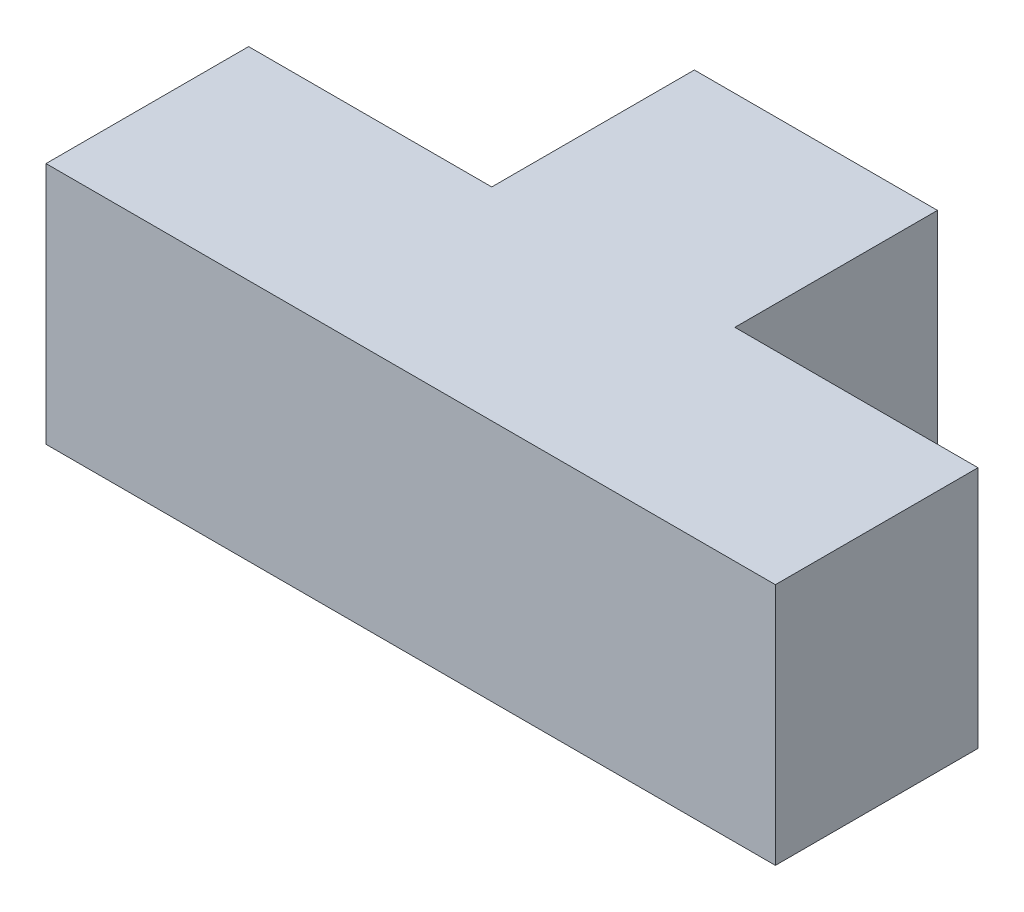
ISO-10303-21;
HEADER;
FILE_DESCRIPTION(('STEP AP214'),'2;1');
FILE_NAME('part.step','',(''),(''),'','','');
FILE_SCHEMA(('AUTOMOTIVE_DESIGN { 1 0 10303 214 1 1 1 1 }'));
ENDSEC;
DATA;
#1=APPLICATION_CONTEXT('core data for automotive mechanical design processes');
#2=APPLICATION_PROTOCOL_DEFINITION('international standard','automotive_design',2000,#1);
#3=PRODUCT_CONTEXT('',#1,'mechanical');
#4=PRODUCT('Part','Part','',(#3));
#5=PRODUCT_RELATED_PRODUCT_CATEGORY('part','',(#4));
#6=PRODUCT_DEFINITION_FORMATION('','',#4);
#7=PRODUCT_DEFINITION_CONTEXT('part definition',#1,'design');
#8=PRODUCT_DEFINITION('design','',#6,#7);
#9=PRODUCT_DEFINITION_SHAPE('','',#8);
#10=(LENGTH_UNIT() NAMED_UNIT(*) SI_UNIT(.MILLI.,.METRE.));
#11=(NAMED_UNIT(*) PLANE_ANGLE_UNIT() SI_UNIT($,.RADIAN.));
#12=(NAMED_UNIT(*) SI_UNIT($,.STERADIAN.) SOLID_ANGLE_UNIT());
#13=UNCERTAINTY_MEASURE_WITH_UNIT(LENGTH_MEASURE(1.E-05),#10,'distance_accuracy_value','');
#14=(GEOMETRIC_REPRESENTATION_CONTEXT(3) GLOBAL_UNCERTAINTY_ASSIGNED_CONTEXT((#13)) GLOBAL_UNIT_ASSIGNED_CONTEXT((#10,
#11,#12)) REPRESENTATION_CONTEXT('',''));
#15=CARTESIAN_POINT('',(0.,0.,0.));
#16=DIRECTION('',(0.,0.,1.));
#17=DIRECTION('',(1.,0.,0.));
#18=AXIS2_PLACEMENT_3D('',#15,#16,#17);
#19=CARTESIAN_POINT('',(90.,30.,0.));
#20=DIRECTION('',(0.,0.,-1.));
#21=DIRECTION('',(-1.,0.,0.));
#22=AXIS2_PLACEMENT_3D('',#19,#20,#21);
#23=PLANE('',#22);
#24=DIRECTION('',(1.,0.,0.));
#25=VECTOR('',#24,1.);
#26=CARTESIAN_POINT('',(90.,0.,0.));
#27=LINE('',#26,#25);
#28=CARTESIAN_POINT('',(0.,0.,0.));
#29=VERTEX_POINT('',#28);
#30=CARTESIAN_POINT('',(90.,0.,0.));
#31=VERTEX_POINT('',#30);
#32=EDGE_CURVE('E129',#29,#31,#27,.T.);
#33=ORIENTED_EDGE('',*,*,#32,.T.);
#34=DIRECTION('',(0.,-1.,0.));
#35=VECTOR('',#34,1.);
#36=CARTESIAN_POINT('',(90.,30.,0.));
#37=LINE('',#36,#35);
#38=CARTESIAN_POINT('',(90.,30.,0.));
#39=VERTEX_POINT('',#38);
#40=EDGE_CURVE('E11',#39,#31,#37,.T.);
#41=ORIENTED_EDGE('',*,*,#40,.F.);
#42=DIRECTION('',(1.,0.,0.));
#43=VECTOR('',#42,1.);
#44=CARTESIAN_POINT('',(90.,30.,0.));
#45=LINE('',#44,#43);
#46=CARTESIAN_POINT('',(0.,30.,0.));
#47=VERTEX_POINT('',#46);
#48=EDGE_CURVE('E143',#47,#39,#45,.T.);
#49=ORIENTED_EDGE('',*,*,#48,.F.);
#50=DIRECTION('',(0.,-1.,0.));
#51=VECTOR('',#50,1.);
#52=CARTESIAN_POINT('',(0.,30.,0.));
#53=LINE('',#52,#51);
#54=EDGE_CURVE('E125',#47,#29,#53,.T.);
#55=ORIENTED_EDGE('',*,*,#54,.T.);
#56=EDGE_LOOP('',(#33,#41,#49,#55));
#57=FACE_BOUND('',#56,.T.);
#58=ADVANCED_FACE('F33',(#57),#23,.F.);
#59=CARTESIAN_POINT('',(90.,30.,-25.));
#60=DIRECTION('',(-1.,0.,0.));
#61=DIRECTION('',(0.,0.,1.));
#62=AXIS2_PLACEMENT_3D('',#59,#60,#61);
#63=PLANE('',#62);
#64=DIRECTION('',(0.,0.,-1.));
#65=VECTOR('',#64,1.);
#66=CARTESIAN_POINT('',(90.,0.,-25.));
#67=LINE('',#66,#65);
#68=CARTESIAN_POINT('',(90.,0.,-25.));
#69=VERTEX_POINT('',#68);
#70=EDGE_CURVE('E132',#31,#69,#67,.T.);
#71=ORIENTED_EDGE('',*,*,#70,.T.);
#72=DIRECTION('',(0.,-1.,0.));
#73=VECTOR('',#72,1.);
#74=CARTESIAN_POINT('',(90.,30.,-25.));
#75=LINE('',#74,#73);
#76=CARTESIAN_POINT('',(90.,30.,-25.));
#77=VERTEX_POINT('',#76);
#78=EDGE_CURVE('E41',#77,#69,#75,.T.);
#79=ORIENTED_EDGE('',*,*,#78,.F.);
#80=DIRECTION('',(0.,0.,-1.));
#81=VECTOR('',#80,1.);
#82=CARTESIAN_POINT('',(90.,30.,-25.));
#83=LINE('',#82,#81);
#84=EDGE_CURVE('E92',#39,#77,#83,.T.);
#85=ORIENTED_EDGE('',*,*,#84,.F.);
#86=ORIENTED_EDGE('',*,*,#40,.T.);
#87=EDGE_LOOP('',(#71,#79,#85,#86));
#88=FACE_BOUND('',#87,.T.);
#89=ADVANCED_FACE('F178',(#88),#63,.F.);
#90=CARTESIAN_POINT('',(60.,30.,-25.));
#91=DIRECTION('',(0.,0.,1.));
#92=DIRECTION('',(1.,0.,0.));
#93=AXIS2_PLACEMENT_3D('',#90,#91,#92);
#94=PLANE('',#93);
#95=DIRECTION('',(-1.,0.,0.));
#96=VECTOR('',#95,1.);
#97=CARTESIAN_POINT('',(60.,0.,-25.));
#98=LINE('',#97,#96);
#99=CARTESIAN_POINT('',(60.,0.,-25.));
#100=VERTEX_POINT('',#99);
#101=EDGE_CURVE('E134',#69,#100,#98,.T.);
#102=ORIENTED_EDGE('',*,*,#101,.T.);
#103=DIRECTION('',(0.,-1.,0.));
#104=VECTOR('',#103,1.);
#105=CARTESIAN_POINT('',(60.,30.,-25.));
#106=LINE('',#105,#104);
#107=CARTESIAN_POINT('',(60.,30.,-25.));
#108=VERTEX_POINT('',#107);
#109=EDGE_CURVE('E150',#108,#100,#106,.T.);
#110=ORIENTED_EDGE('',*,*,#109,.F.);
#111=DIRECTION('',(-1.,0.,0.));
#112=VECTOR('',#111,1.);
#113=CARTESIAN_POINT('',(60.,30.,-25.));
#114=LINE('',#113,#112);
#115=EDGE_CURVE('E158',#77,#108,#114,.T.);
#116=ORIENTED_EDGE('',*,*,#115,.F.);
#117=ORIENTED_EDGE('',*,*,#78,.T.);
#118=EDGE_LOOP('',(#102,#110,#116,#117));
#119=FACE_BOUND('',#118,.T.);
#120=ADVANCED_FACE('F156',(#119),#94,.F.);
#121=CARTESIAN_POINT('',(60.,30.,-50.));
#122=DIRECTION('',(-1.,0.,0.));
#123=DIRECTION('',(0.,0.,1.));
#124=AXIS2_PLACEMENT_3D('',#121,#122,#123);
#125=PLANE('',#124);
#126=DIRECTION('',(0.,0.,-1.));
#127=VECTOR('',#126,1.);
#128=CARTESIAN_POINT('',(60.,0.,-50.));
#129=LINE('',#128,#127);
#130=CARTESIAN_POINT('',(60.,0.,-50.));
#131=VERTEX_POINT('',#130);
#132=EDGE_CURVE('E136',#100,#131,#129,.T.);
#133=ORIENTED_EDGE('',*,*,#132,.T.);
#134=DIRECTION('',(0.,-1.,0.));
#135=VECTOR('',#134,1.);
#136=CARTESIAN_POINT('',(60.,30.,-50.));
#137=LINE('',#136,#135);
#138=CARTESIAN_POINT('',(60.,30.,-50.));
#139=VERTEX_POINT('',#138);
#140=EDGE_CURVE('E147',#139,#131,#137,.T.);
#141=ORIENTED_EDGE('',*,*,#140,.F.);
#142=DIRECTION('',(0.,0.,-1.));
#143=VECTOR('',#142,1.);
#144=CARTESIAN_POINT('',(60.,30.,-50.));
#145=LINE('',#144,#143);
#146=EDGE_CURVE('E170',#108,#139,#145,.T.);
#147=ORIENTED_EDGE('',*,*,#146,.F.);
#148=ORIENTED_EDGE('',*,*,#109,.T.);
#149=EDGE_LOOP('',(#133,#141,#147,#148));
#150=FACE_BOUND('',#149,.T.);
#151=ADVANCED_FACE('F166',(#150),#125,.F.);
#152=CARTESIAN_POINT('',(30.,30.,-50.));
#153=DIRECTION('',(0.,0.,1.));
#154=DIRECTION('',(1.,0.,0.));
#155=AXIS2_PLACEMENT_3D('',#152,#153,#154);
#156=PLANE('',#155);
#157=DIRECTION('',(-1.,0.,0.));
#158=VECTOR('',#157,1.);
#159=CARTESIAN_POINT('',(30.,0.,-50.));
#160=LINE('',#159,#158);
#161=CARTESIAN_POINT('',(30.,0.,-50.));
#162=VERTEX_POINT('',#161);
#163=EDGE_CURVE('E138',#131,#162,#160,.T.);
#164=ORIENTED_EDGE('',*,*,#163,.T.);
#165=DIRECTION('',(0.,-1.,0.));
#166=VECTOR('',#165,1.);
#167=CARTESIAN_POINT('',(30.,30.,-50.));
#168=LINE('',#167,#166);
#169=CARTESIAN_POINT('',(30.,30.,-50.));
#170=VERTEX_POINT('',#169);
#171=EDGE_CURVE('E120',#170,#162,#168,.T.);
#172=ORIENTED_EDGE('',*,*,#171,.F.);
#173=DIRECTION('',(-1.,0.,0.));
#174=VECTOR('',#173,1.);
#175=CARTESIAN_POINT('',(30.,30.,-50.));
#176=LINE('',#175,#174);
#177=EDGE_CURVE('E111',#139,#170,#176,.T.);
#178=ORIENTED_EDGE('',*,*,#177,.F.);
#179=ORIENTED_EDGE('',*,*,#140,.T.);
#180=EDGE_LOOP('',(#164,#172,#178,#179));
#181=FACE_BOUND('',#180,.T.);
#182=ADVANCED_FACE('F169',(#181),#156,.F.);
#183=CARTESIAN_POINT('',(30.,30.,-25.));
#184=DIRECTION('',(1.,0.,0.));
#185=DIRECTION('',(0.,0.,-1.));
#186=AXIS2_PLACEMENT_3D('',#183,#184,#185);
#187=PLANE('',#186);
#188=DIRECTION('',(0.,0.,1.));
#189=VECTOR('',#188,1.);
#190=CARTESIAN_POINT('',(30.,0.,-25.));
#191=LINE('',#190,#189);
#192=CARTESIAN_POINT('',(30.,0.,-25.));
#193=VERTEX_POINT('',#192);
#194=EDGE_CURVE('E119',#162,#193,#191,.T.);
#195=ORIENTED_EDGE('',*,*,#194,.T.);
#196=DIRECTION('',(0.,-1.,0.));
#197=VECTOR('',#196,1.);
#198=CARTESIAN_POINT('',(30.,30.,-25.));
#199=LINE('',#198,#197);
#200=CARTESIAN_POINT('',(30.,30.,-25.));
#201=VERTEX_POINT('',#200);
#202=EDGE_CURVE('E116',#201,#193,#199,.T.);
#203=ORIENTED_EDGE('',*,*,#202,.F.);
#204=DIRECTION('',(0.,0.,1.));
#205=VECTOR('',#204,1.);
#206=CARTESIAN_POINT('',(30.,30.,-25.));
#207=LINE('',#206,#205);
#208=EDGE_CURVE('E105',#170,#201,#207,.T.);
#209=ORIENTED_EDGE('',*,*,#208,.F.);
#210=ORIENTED_EDGE('',*,*,#171,.T.);
#211=EDGE_LOOP('',(#195,#203,#209,#210));
#212=FACE_BOUND('',#211,.T.);
#213=ADVANCED_FACE('F117',(#212),#187,.F.);
#214=CARTESIAN_POINT('',(0.,30.,-25.));
#215=DIRECTION('',(0.,0.,1.));
#216=DIRECTION('',(1.,0.,0.));
#217=AXIS2_PLACEMENT_3D('',#214,#215,#216);
#218=PLANE('',#217);
#219=DIRECTION('',(-1.,0.,0.));
#220=VECTOR('',#219,1.);
#221=CARTESIAN_POINT('',(0.,0.,-25.));
#222=LINE('',#221,#220);
#223=CARTESIAN_POINT('',(0.,0.,-25.));
#224=VERTEX_POINT('',#223);
#225=EDGE_CURVE('E78',#193,#224,#222,.T.);
#226=ORIENTED_EDGE('',*,*,#225,.T.);
#227=DIRECTION('',(0.,-1.,0.));
#228=VECTOR('',#227,1.);
#229=CARTESIAN_POINT('',(0.,30.,-25.));
#230=LINE('',#229,#228);
#231=CARTESIAN_POINT('',(0.,30.,-25.));
#232=VERTEX_POINT('',#231);
#233=EDGE_CURVE('E121',#232,#224,#230,.T.);
#234=ORIENTED_EDGE('',*,*,#233,.F.);
#235=DIRECTION('',(-1.,0.,0.));
#236=VECTOR('',#235,1.);
#237=CARTESIAN_POINT('',(0.,30.,-25.));
#238=LINE('',#237,#236);
#239=EDGE_CURVE('E109',#201,#232,#238,.T.);
#240=ORIENTED_EDGE('',*,*,#239,.F.);
#241=ORIENTED_EDGE('',*,*,#202,.T.);
#242=EDGE_LOOP('',(#226,#234,#240,#241));
#243=FACE_BOUND('',#242,.T.);
#244=ADVANCED_FACE('F123',(#243),#218,.F.);
#245=CARTESIAN_POINT('',(0.,30.,0.));
#246=DIRECTION('',(1.,0.,0.));
#247=DIRECTION('',(0.,0.,-1.));
#248=AXIS2_PLACEMENT_3D('',#245,#246,#247);
#249=PLANE('',#248);
#250=DIRECTION('',(0.,0.,1.));
#251=VECTOR('',#250,1.);
#252=CARTESIAN_POINT('',(0.,0.,0.));
#253=LINE('',#252,#251);
#254=EDGE_CURVE('E84',#224,#29,#253,.T.);
#255=ORIENTED_EDGE('',*,*,#254,.T.);
#256=ORIENTED_EDGE('',*,*,#54,.F.);
#257=DIRECTION('',(0.,0.,1.));
#258=VECTOR('',#257,1.);
#259=CARTESIAN_POINT('',(0.,30.,0.));
#260=LINE('',#259,#258);
#261=EDGE_CURVE('E49',#232,#47,#260,.T.);
#262=ORIENTED_EDGE('',*,*,#261,.F.);
#263=ORIENTED_EDGE('',*,*,#233,.T.);
#264=EDGE_LOOP('',(#255,#256,#262,#263));
#265=FACE_BOUND('',#264,.T.);
#266=ADVANCED_FACE('F194',(#265),#249,.F.);
#267=CARTESIAN_POINT('',(0.,30.,0.));
#268=DIRECTION('',(0.,-1.,0.));
#269=DIRECTION('',(0.,0.,-1.));
#270=AXIS2_PLACEMENT_3D('',#267,#268,#269);
#271=PLANE('',#270);
#272=ORIENTED_EDGE('',*,*,#48,.T.);
#273=ORIENTED_EDGE('',*,*,#84,.T.);
#274=ORIENTED_EDGE('',*,*,#115,.T.);
#275=ORIENTED_EDGE('',*,*,#146,.T.);
#276=ORIENTED_EDGE('',*,*,#177,.T.);
#277=ORIENTED_EDGE('',*,*,#208,.T.);
#278=ORIENTED_EDGE('',*,*,#239,.T.);
#279=ORIENTED_EDGE('',*,*,#261,.T.);
#280=EDGE_LOOP('',(#272,#273,#274,#275,#276,#277,#278,#279));
#281=FACE_BOUND('',#280,.T.);
#282=ADVANCED_FACE('F107',(#281),#271,.F.);
#283=CARTESIAN_POINT('',(0.,0.,0.));
#284=DIRECTION('',(0.,-1.,0.));
#285=DIRECTION('',(0.,0.,-1.));
#286=AXIS2_PLACEMENT_3D('',#283,#284,#285);
#287=PLANE('',#286);
#288=ORIENTED_EDGE('',*,*,#32,.F.);
#289=ORIENTED_EDGE('',*,*,#254,.F.);
#290=ORIENTED_EDGE('',*,*,#225,.F.);
#291=ORIENTED_EDGE('',*,*,#194,.F.);
#292=ORIENTED_EDGE('',*,*,#163,.F.);
#293=ORIENTED_EDGE('',*,*,#132,.F.);
#294=ORIENTED_EDGE('',*,*,#101,.F.);
#295=ORIENTED_EDGE('',*,*,#70,.F.);
#296=EDGE_LOOP('',(#288,#289,#290,#291,#292,#293,#294,#295));
#297=FACE_BOUND('',#296,.T.);
#298=ADVANCED_FACE('F162',(#297),#287,.T.);
#299=CLOSED_SHELL('',(#58,#89,#120,#151,#182,#213,#244,#266,#282,#298));
#300=MANIFOLD_SOLID_BREP('B2',#299);
#301=ADVANCED_BREP_SHAPE_REPRESENTATION('',(#18,#300),#14);
#302=SHAPE_DEFINITION_REPRESENTATION(#9,#301);
ENDSEC;
END-ISO-10303-21;
